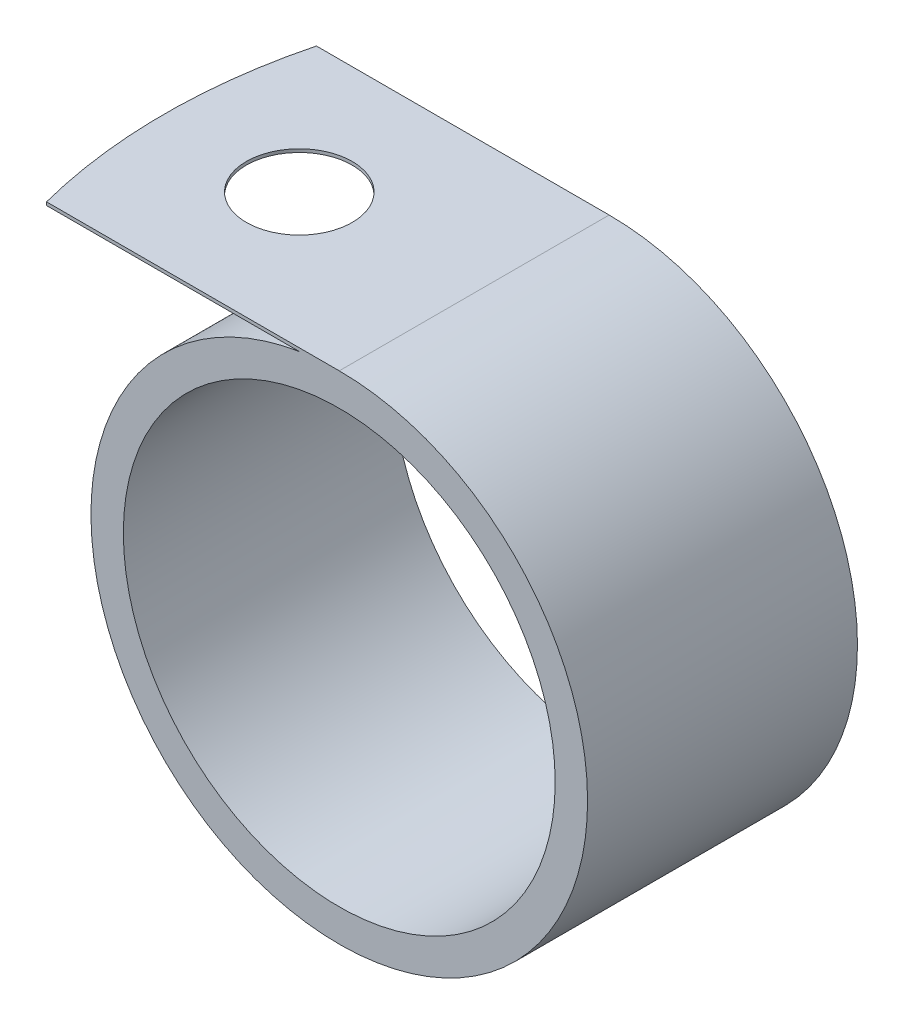
ISO-10303-21;
HEADER;
FILE_DESCRIPTION(('STEP AP214'),'2;1');
FILE_NAME('part.step','',(''),(''),'','','');
FILE_SCHEMA(('AUTOMOTIVE_DESIGN { 1 0 10303 214 1 1 1 1 }'));
ENDSEC;
DATA;
#1=APPLICATION_CONTEXT('core data for automotive mechanical design processes');
#2=APPLICATION_PROTOCOL_DEFINITION('international standard','automotive_design',2000,#1);
#3=PRODUCT_CONTEXT('',#1,'mechanical');
#4=PRODUCT('Part','Part','',(#3));
#5=PRODUCT_RELATED_PRODUCT_CATEGORY('part','',(#4));
#6=PRODUCT_DEFINITION_FORMATION('','',#4);
#7=PRODUCT_DEFINITION_CONTEXT('part definition',#1,'design');
#8=PRODUCT_DEFINITION('design','',#6,#7);
#9=PRODUCT_DEFINITION_SHAPE('','',#8);
#10=(LENGTH_UNIT() NAMED_UNIT(*) SI_UNIT(.MILLI.,.METRE.));
#11=(NAMED_UNIT(*) PLANE_ANGLE_UNIT() SI_UNIT($,.RADIAN.));
#12=(NAMED_UNIT(*) SI_UNIT($,.STERADIAN.) SOLID_ANGLE_UNIT());
#13=UNCERTAINTY_MEASURE_WITH_UNIT(LENGTH_MEASURE(1.E-05),#10,'distance_accuracy_value','');
#14=(GEOMETRIC_REPRESENTATION_CONTEXT(3) GLOBAL_UNCERTAINTY_ASSIGNED_CONTEXT((#13)) GLOBAL_UNIT_ASSIGNED_CONTEXT((#10,
#11,#12)) REPRESENTATION_CONTEXT('',''));
#15=CARTESIAN_POINT('',(0.,0.,0.));
#16=DIRECTION('',(0.,0.,1.));
#17=DIRECTION('',(1.,0.,0.));
#18=AXIS2_PLACEMENT_3D('',#15,#16,#17);
#19=CARTESIAN_POINT('',(0.,11.684,6.35));
#20=DIRECTION('',(0.,-1.,0.));
#21=DIRECTION('',(0.,0.,-1.));
#22=AXIS2_PLACEMENT_3D('',#19,#20,#21);
#23=PLANE('',#22);
#24=CARTESIAN_POINT('',(-8.23097247188788,11.684,0.));
#25=DIRECTION('',(0.,1.,0.));
#26=DIRECTION('',(-1.,0.,0.));
#27=AXIS2_PLACEMENT_3D('',#24,#25,#26);
#28=CIRCLE('',#27,2.4892);
#29=CARTESIAN_POINT('',(-10.7201724718879,11.684,0.));
#30=VERTEX_POINT('',#29);
#31=EDGE_CURVE('E102',#30,#30,#28,.T.);
#32=ORIENTED_EDGE('',*,*,#31,.F.);
#33=EDGE_LOOP('',(#32));
#34=FACE_BOUND('',#33,.T.);
#35=CARTESIAN_POINT('',(10.8190275281121,11.684,0.));
#36=DIRECTION('',(0.,1.,0.));
#37=DIRECTION('',(-1.,0.,0.));
#38=AXIS2_PLACEMENT_3D('',#35,#36,#37);
#39=CIRCLE('',#38,25.4);
#40=CARTESIAN_POINT('',(-13.774416720305,11.684,-6.35));
#41=VERTEX_POINT('',#40);
#42=CARTESIAN_POINT('',(-13.774416720305,11.684,6.35));
#43=VERTEX_POINT('',#42);
#44=EDGE_CURVE('E106',#41,#43,#39,.T.);
#45=ORIENTED_EDGE('',*,*,#44,.T.);
#46=DIRECTION('',(-1.,0.,0.));
#47=VECTOR('',#46,1.);
#48=CARTESIAN_POINT('',(0.,11.684,6.35));
#49=LINE('',#48,#47);
#50=CARTESIAN_POINT('',(0.,11.684,6.35));
#51=VERTEX_POINT('',#50);
#52=EDGE_CURVE('E93',#51,#43,#49,.T.);
#53=ORIENTED_EDGE('',*,*,#52,.F.);
#54=DIRECTION('',(0.,0.,-1.));
#55=VECTOR('',#54,1.);
#56=CARTESIAN_POINT('',(0.,11.684,6.35));
#57=LINE('',#56,#55);
#58=CARTESIAN_POINT('',(0.,11.684,-6.35));
#59=VERTEX_POINT('',#58);
#60=EDGE_CURVE('E11',#51,#59,#57,.T.);
#61=ORIENTED_EDGE('',*,*,#60,.T.);
#62=DIRECTION('',(-1.,0.,0.));
#63=VECTOR('',#62,1.);
#64=CARTESIAN_POINT('',(0.,11.684,-6.35));
#65=LINE('',#64,#63);
#66=EDGE_CURVE('E77',#59,#41,#65,.T.);
#67=ORIENTED_EDGE('',*,*,#66,.T.);
#68=EDGE_LOOP('',(#45,#53,#61,#67));
#69=FACE_BOUND('',#68,.T.);
#70=ADVANCED_FACE('F32',(#34,#69),#23,.F.);
#71=CARTESIAN_POINT('',(-14.5809724718879,11.5316,6.35));
#72=DIRECTION('',(0.,1.,0.));
#73=DIRECTION('',(0.,0.,1.));
#74=AXIS2_PLACEMENT_3D('',#71,#72,#73);
#75=PLANE('',#74);
#76=CARTESIAN_POINT('',(-8.23097247188788,11.5316,0.));
#77=DIRECTION('',(0.,1.,0.));
#78=DIRECTION('',(0.,0.,1.));
#79=AXIS2_PLACEMENT_3D('',#76,#77,#78);
#80=CIRCLE('',#79,2.4892);
#81=CARTESIAN_POINT('',(-8.23097247188788,11.5316,2.4892));
#82=VERTEX_POINT('',#81);
#83=EDGE_CURVE('E98',#82,#82,#80,.F.);
#84=ORIENTED_EDGE('',*,*,#83,.F.);
#85=EDGE_LOOP('',(#84));
#86=FACE_BOUND('',#85,.T.);
#87=DIRECTION('',(1.,0.,0.));
#88=VECTOR('',#87,1.);
#89=CARTESIAN_POINT('',(-14.5809724718879,11.5316,6.35));
#90=LINE('',#89,#88);
#91=CARTESIAN_POINT('',(-13.774416720305,11.5316,6.35));
#92=VERTEX_POINT('',#91);
#93=CARTESIAN_POINT('',(-1.88097247188788,11.5316,6.35));
#94=VERTEX_POINT('',#93);
#95=EDGE_CURVE('E56',#92,#94,#90,.T.);
#96=ORIENTED_EDGE('',*,*,#95,.F.);
#97=CARTESIAN_POINT('',(10.8190275281121,11.5316,0.));
#98=DIRECTION('',(0.,1.,0.));
#99=DIRECTION('',(0.,0.,1.));
#100=AXIS2_PLACEMENT_3D('',#97,#98,#99);
#101=CIRCLE('',#100,25.4);
#102=CARTESIAN_POINT('',(-13.774416720305,11.5316,-6.35));
#103=VERTEX_POINT('',#102);
#104=EDGE_CURVE('E73',#92,#103,#101,.F.);
#105=ORIENTED_EDGE('',*,*,#104,.T.);
#106=DIRECTION('',(1.,0.,0.));
#107=VECTOR('',#106,1.);
#108=CARTESIAN_POINT('',(-14.5809724718879,11.5316,-6.35));
#109=LINE('',#108,#107);
#110=CARTESIAN_POINT('',(-1.88097247188788,11.5316,-6.35));
#111=VERTEX_POINT('',#110);
#112=EDGE_CURVE('E69',#103,#111,#109,.T.);
#113=ORIENTED_EDGE('',*,*,#112,.T.);
#114=DIRECTION('',(0.,0.,-1.));
#115=VECTOR('',#114,1.);
#116=CARTESIAN_POINT('',(-1.88097247188788,11.5316,6.35));
#117=LINE('',#116,#115);
#118=EDGE_CURVE('E40',#94,#111,#117,.T.);
#119=ORIENTED_EDGE('',*,*,#118,.F.);
#120=EDGE_LOOP('',(#96,#105,#113,#119));
#121=FACE_BOUND('',#120,.T.);
#122=ADVANCED_FACE('F71',(#86,#121),#75,.F.);
#123=CARTESIAN_POINT('',(0.,0.,6.35));
#124=DIRECTION('',(0.,0.,1.));
#125=DIRECTION('',(1.,0.,0.));
#126=AXIS2_PLACEMENT_3D('',#123,#124,#125);
#127=PLANE('',#126);
#128=CARTESIAN_POINT('',(0.,0.,6.35));
#129=DIRECTION('',(0.,0.,1.));
#130=DIRECTION('',(1.,0.,0.));
#131=AXIS2_PLACEMENT_3D('',#128,#129,#130);
#132=CIRCLE('',#131,10.16);
#133=CARTESIAN_POINT('',(10.16,0.,6.35));
#134=VERTEX_POINT('',#133);
#135=EDGE_CURVE('E85',#134,#134,#132,.T.);
#136=ORIENTED_EDGE('',*,*,#135,.F.);
#137=EDGE_LOOP('',(#136));
#138=FACE_BOUND('',#137,.T.);
#139=ORIENTED_EDGE('',*,*,#52,.T.);
#140=DIRECTION('',(0.,1.,0.));
#141=VECTOR('',#140,1.);
#142=CARTESIAN_POINT('',(-13.774416720305,-11.685,6.35));
#143=LINE('',#142,#141);
#144=EDGE_CURVE('E110',#92,#43,#143,.T.);
#145=ORIENTED_EDGE('',*,*,#144,.F.);
#146=ORIENTED_EDGE('',*,*,#95,.T.);
#147=CARTESIAN_POINT('',(0.,0.,6.35));
#148=DIRECTION('',(0.,0.,1.));
#149=DIRECTION('',(1.,0.,0.));
#150=AXIS2_PLACEMENT_3D('',#147,#148,#149);
#151=CIRCLE('',#150,11.684);
#152=EDGE_CURVE('E76',#94,#51,#151,.T.);
#153=ORIENTED_EDGE('',*,*,#152,.T.);
#154=EDGE_LOOP('',(#139,#145,#146,#153));
#155=FACE_BOUND('',#154,.T.);
#156=ADVANCED_FACE('F116',(#138,#155),#127,.T.);
#157=CARTESIAN_POINT('',(0.,0.,-6.35));
#158=DIRECTION('',(0.,0.,1.));
#159=DIRECTION('',(1.,0.,0.));
#160=AXIS2_PLACEMENT_3D('',#157,#158,#159);
#161=PLANE('',#160);
#162=CARTESIAN_POINT('',(0.,0.,-6.35));
#163=DIRECTION('',(0.,0.,1.));
#164=DIRECTION('',(1.,0.,0.));
#165=AXIS2_PLACEMENT_3D('',#162,#163,#164);
#166=CIRCLE('',#165,10.16);
#167=CARTESIAN_POINT('',(10.16,0.,-6.35));
#168=VERTEX_POINT('',#167);
#169=EDGE_CURVE('E89',#168,#168,#166,.T.);
#170=ORIENTED_EDGE('',*,*,#169,.T.);
#171=EDGE_LOOP('',(#170));
#172=FACE_BOUND('',#171,.T.);
#173=DIRECTION('',(0.,1.,0.));
#174=VECTOR('',#173,1.);
#175=CARTESIAN_POINT('',(-13.774416720305,-11.685,-6.35));
#176=LINE('',#175,#174);
#177=EDGE_CURVE('E47',#103,#41,#176,.T.);
#178=ORIENTED_EDGE('',*,*,#177,.T.);
#179=ORIENTED_EDGE('',*,*,#66,.F.);
#180=CARTESIAN_POINT('',(0.,0.,-6.35));
#181=DIRECTION('',(0.,0.,1.));
#182=DIRECTION('',(1.,0.,0.));
#183=AXIS2_PLACEMENT_3D('',#180,#181,#182);
#184=CIRCLE('',#183,11.684);
#185=EDGE_CURVE('E82',#111,#59,#184,.T.);
#186=ORIENTED_EDGE('',*,*,#185,.F.);
#187=ORIENTED_EDGE('',*,*,#112,.F.);
#188=EDGE_LOOP('',(#178,#179,#186,#187));
#189=FACE_BOUND('',#188,.T.);
#190=ADVANCED_FACE('F83',(#172,#189),#161,.F.);
#191=CARTESIAN_POINT('',(0.,0.,6.35));
#192=DIRECTION('',(0.,0.,-1.));
#193=DIRECTION('',(-1.,0.,0.));
#194=AXIS2_PLACEMENT_3D('',#191,#192,#193);
#195=CYLINDRICAL_SURFACE('',#194,11.684);
#196=ORIENTED_EDGE('',*,*,#185,.T.);
#197=ORIENTED_EDGE('',*,*,#60,.F.);
#198=ORIENTED_EDGE('',*,*,#152,.F.);
#199=ORIENTED_EDGE('',*,*,#118,.T.);
#200=EDGE_LOOP('',(#196,#197,#198,#199));
#201=FACE_BOUND('',#200,.T.);
#202=ADVANCED_FACE('F34',(#201),#195,.T.);
#203=CARTESIAN_POINT('',(0.,0.,6.35));
#204=DIRECTION('',(0.,0.,-1.));
#205=DIRECTION('',(-1.,0.,0.));
#206=AXIS2_PLACEMENT_3D('',#203,#204,#205);
#207=CYLINDRICAL_SURFACE('',#206,10.16);
#208=ORIENTED_EDGE('',*,*,#135,.T.);
#209=EDGE_LOOP('',(#208));
#210=FACE_BOUND('',#209,.T.);
#211=ORIENTED_EDGE('',*,*,#169,.F.);
#212=EDGE_LOOP('',(#211));
#213=FACE_BOUND('',#212,.T.);
#214=ADVANCED_FACE('F134',(#210,#213),#207,.F.);
#215=CARTESIAN_POINT('',(-8.23097247188788,-11.685,0.));
#216=DIRECTION('',(0.,1.,0.));
#217=DIRECTION('',(-1.,0.,0.));
#218=AXIS2_PLACEMENT_3D('',#215,#216,#217);
#219=CYLINDRICAL_SURFACE('',#218,2.4892);
#220=ORIENTED_EDGE('',*,*,#31,.T.);
#221=EDGE_LOOP('',(#220));
#222=FACE_BOUND('',#221,.T.);
#223=ORIENTED_EDGE('',*,*,#83,.T.);
#224=EDGE_LOOP('',(#223));
#225=FACE_BOUND('',#224,.T.);
#226=ADVANCED_FACE('F137',(#222,#225),#219,.F.);
#227=CARTESIAN_POINT('',(10.8190275281121,-11.685,0.));
#228=DIRECTION('',(0.,1.,0.));
#229=DIRECTION('',(-1.,0.,0.));
#230=AXIS2_PLACEMENT_3D('',#227,#228,#229);
#231=CYLINDRICAL_SURFACE('',#230,25.4);
#232=ORIENTED_EDGE('',*,*,#104,.F.);
#233=ORIENTED_EDGE('',*,*,#144,.T.);
#234=ORIENTED_EDGE('',*,*,#44,.F.);
#235=ORIENTED_EDGE('',*,*,#177,.F.);
#236=EDGE_LOOP('',(#232,#233,#234,#235));
#237=FACE_BOUND('',#236,.T.);
#238=ADVANCED_FACE('F113',(#237),#231,.T.);
#239=CLOSED_SHELL('',(#70,#122,#156,#190,#202,#214,#226,#238));
#240=MANIFOLD_SOLID_BREP('B2',#239);
#241=ADVANCED_BREP_SHAPE_REPRESENTATION('',(#18,#240),#14);
#242=SHAPE_DEFINITION_REPRESENTATION(#9,#241);
ENDSEC;
END-ISO-10303-21;
